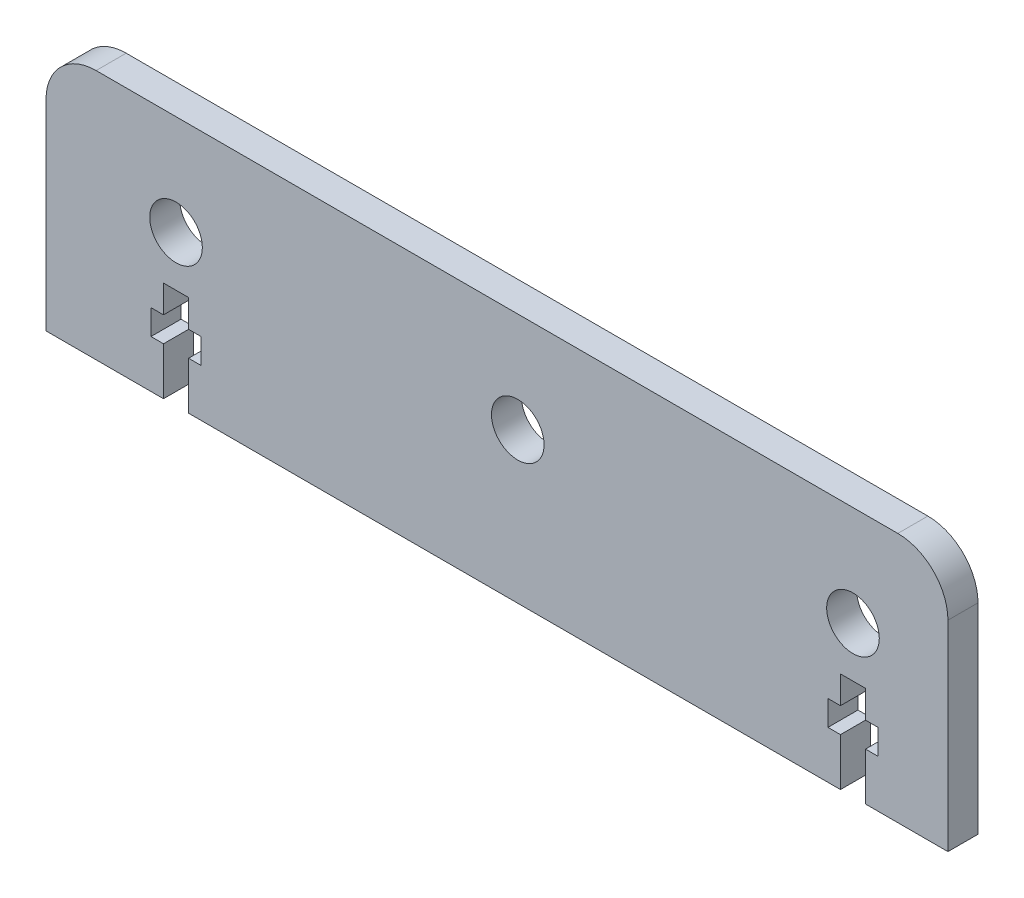
ISO-10303-21;
HEADER;
FILE_DESCRIPTION(('STEP AP214'),'2;1');
FILE_NAME('part.step','',(''),(''),'','','');
FILE_SCHEMA(('AUTOMOTIVE_DESIGN { 1 0 10303 214 1 1 1 1 }'));
ENDSEC;
DATA;
#1=APPLICATION_CONTEXT('core data for automotive mechanical design processes');
#2=APPLICATION_PROTOCOL_DEFINITION('international standard','automotive_design',2000,#1);
#3=PRODUCT_CONTEXT('',#1,'mechanical');
#4=PRODUCT('Part','Part','',(#3));
#5=PRODUCT_RELATED_PRODUCT_CATEGORY('part','',(#4));
#6=PRODUCT_DEFINITION_FORMATION('','',#4);
#7=PRODUCT_DEFINITION_CONTEXT('part definition',#1,'design');
#8=PRODUCT_DEFINITION('design','',#6,#7);
#9=PRODUCT_DEFINITION_SHAPE('','',#8);
#10=(LENGTH_UNIT() NAMED_UNIT(*) SI_UNIT(.MILLI.,.METRE.));
#11=(NAMED_UNIT(*) PLANE_ANGLE_UNIT() SI_UNIT($,.RADIAN.));
#12=(NAMED_UNIT(*) SI_UNIT($,.STERADIAN.) SOLID_ANGLE_UNIT());
#13=UNCERTAINTY_MEASURE_WITH_UNIT(LENGTH_MEASURE(1.E-05),#10,'distance_accuracy_value','');
#14=(GEOMETRIC_REPRESENTATION_CONTEXT(3) GLOBAL_UNCERTAINTY_ASSIGNED_CONTEXT((#13)) GLOBAL_UNIT_ASSIGNED_CONTEXT((#10,
#11,#12)) REPRESENTATION_CONTEXT('',''));
#15=CARTESIAN_POINT('',(0.,0.,0.));
#16=DIRECTION('',(0.,0.,1.));
#17=DIRECTION('',(1.,0.,0.));
#18=AXIS2_PLACEMENT_3D('',#15,#16,#17);
#19=CARTESIAN_POINT('',(90.,-25.,6.));
#20=DIRECTION('',(0.,1.,0.));
#21=DIRECTION('',(-1.,0.,0.));
#22=AXIS2_PLACEMENT_3D('',#19,#20,#21);
#23=PLANE('',#22);
#24=DIRECTION('',(0.,0.,-1.));
#25=VECTOR('',#24,1.);
#26=CARTESIAN_POINT('',(68.55,-25.,6.));
#27=LINE('',#26,#25);
#28=CARTESIAN_POINT('',(68.55,-25.,6.));
#29=VERTEX_POINT('',#28);
#30=CARTESIAN_POINT('',(68.55,-25.,0.));
#31=VERTEX_POINT('',#30);
#32=EDGE_CURVE('E342',#29,#31,#27,.T.);
#33=ORIENTED_EDGE('',*,*,#32,.F.);
#34=DIRECTION('',(1.,0.,0.));
#35=VECTOR('',#34,1.);
#36=CARTESIAN_POINT('',(90.,-25.,6.));
#37=LINE('',#36,#35);
#38=CARTESIAN_POINT('',(-61.55,-25.,6.));
#39=VERTEX_POINT('',#38);
#40=EDGE_CURVE('E465',#39,#29,#37,.T.);
#41=ORIENTED_EDGE('',*,*,#40,.F.);
#42=DIRECTION('',(0.,0.,-1.));
#43=VECTOR('',#42,1.);
#44=CARTESIAN_POINT('',(-61.55,-25.,6.));
#45=LINE('',#44,#43);
#46=CARTESIAN_POINT('',(-61.55,-25.,0.));
#47=VERTEX_POINT('',#46);
#48=EDGE_CURVE('E393',#39,#47,#45,.T.);
#49=ORIENTED_EDGE('',*,*,#48,.T.);
#50=DIRECTION('',(1.,0.,0.));
#51=VECTOR('',#50,1.);
#52=CARTESIAN_POINT('',(90.,-25.,0.));
#53=LINE('',#52,#51);
#54=EDGE_CURVE('E478',#47,#31,#53,.T.);
#55=ORIENTED_EDGE('',*,*,#54,.T.);
#56=EDGE_LOOP('',(#33,#41,#49,#55));
#57=FACE_BOUND('',#56,.T.);
#58=ADVANCED_FACE('F95',(#57),#23,.F.);
#59=CARTESIAN_POINT('',(0.,0.,6.));
#60=DIRECTION('',(0.,0.,1.));
#61=DIRECTION('',(1.,0.,0.));
#62=AXIS2_PLACEMENT_3D('',#59,#60,#61);
#63=PLANE('',#62);
#64=CARTESIAN_POINT('',(71.05,4.99999999999998,6.));
#65=DIRECTION('',(0.,0.,1.));
#66=DIRECTION('',(1.,0.,0.));
#67=AXIS2_PLACEMENT_3D('',#64,#65,#66);
#68=CIRCLE('',#67,5.25);
#69=CARTESIAN_POINT('',(76.3,4.99999999999998,6.));
#70=VERTEX_POINT('',#69);
#71=EDGE_CURVE('E438',#70,#70,#68,.T.);
#72=ORIENTED_EDGE('',*,*,#71,.F.);
#73=EDGE_LOOP('',(#72));
#74=FACE_BOUND('',#73,.T.);
#75=CARTESIAN_POINT('',(4.15000000000001,4.99999999999998,6.));
#76=DIRECTION('',(0.,0.,1.));
#77=DIRECTION('',(1.,0.,0.));
#78=AXIS2_PLACEMENT_3D('',#75,#76,#77);
#79=CIRCLE('',#78,5.25);
#80=CARTESIAN_POINT('',(9.40000000000002,4.99999999999998,6.));
#81=VERTEX_POINT('',#80);
#82=EDGE_CURVE('E442',#81,#81,#79,.T.);
#83=ORIENTED_EDGE('',*,*,#82,.F.);
#84=EDGE_LOOP('',(#83));
#85=FACE_BOUND('',#84,.T.);
#86=CARTESIAN_POINT('',(-64.05,4.99999999999998,6.));
#87=DIRECTION('',(0.,0.,1.));
#88=DIRECTION('',(1.,0.,0.));
#89=AXIS2_PLACEMENT_3D('',#86,#87,#88);
#90=CIRCLE('',#89,5.25);
#91=CARTESIAN_POINT('',(-58.8,4.99999999999998,6.));
#92=VERTEX_POINT('',#91);
#93=EDGE_CURVE('E448',#92,#92,#90,.T.);
#94=ORIENTED_EDGE('',*,*,#93,.F.);
#95=EDGE_LOOP('',(#94));
#96=FACE_BOUND('',#95,.T.);
#97=ORIENTED_EDGE('',*,*,#40,.T.);
#98=DIRECTION('',(0.,-1.,0.));
#99=VECTOR('',#98,1.);
#100=CARTESIAN_POINT('',(68.55,-5.00000000000002,6.));
#101=LINE('',#100,#99);
#102=CARTESIAN_POINT('',(68.55,-15.5,6.));
#103=VERTEX_POINT('',#102);
#104=EDGE_CURVE('E363',#103,#29,#101,.T.);
#105=ORIENTED_EDGE('',*,*,#104,.F.);
#106=DIRECTION('',(1.,0.,0.));
#107=VECTOR('',#106,1.);
#108=CARTESIAN_POINT('',(66.05,-15.5,6.));
#109=LINE('',#108,#107);
#110=CARTESIAN_POINT('',(66.05,-15.5,6.));
#111=VERTEX_POINT('',#110);
#112=EDGE_CURVE('E330',#111,#103,#109,.T.);
#113=ORIENTED_EDGE('',*,*,#112,.F.);
#114=DIRECTION('',(0.,-1.,0.));
#115=VECTOR('',#114,1.);
#116=CARTESIAN_POINT('',(66.05,-10.5,6.));
#117=LINE('',#116,#115);
#118=CARTESIAN_POINT('',(66.05,-10.5,6.));
#119=VERTEX_POINT('',#118);
#120=EDGE_CURVE('E328',#119,#111,#117,.T.);
#121=ORIENTED_EDGE('',*,*,#120,.F.);
#122=DIRECTION('',(1.,0.,0.));
#123=VECTOR('',#122,1.);
#124=CARTESIAN_POINT('',(66.05,-10.5,6.));
#125=LINE('',#124,#123);
#126=CARTESIAN_POINT('',(68.55,-10.5,6.));
#127=VERTEX_POINT('',#126);
#128=EDGE_CURVE('E299',#119,#127,#125,.T.);
#129=ORIENTED_EDGE('',*,*,#128,.T.);
#130=CARTESIAN_POINT('',(68.55,-5.00000000000002,6.));
#131=VERTEX_POINT('',#130);
#132=EDGE_CURVE('E360',#131,#127,#101,.T.);
#133=ORIENTED_EDGE('',*,*,#132,.F.);
#134=DIRECTION('',(-1.,0.,0.));
#135=VECTOR('',#134,1.);
#136=CARTESIAN_POINT('',(73.55,-5.00000000000002,6.));
#137=LINE('',#136,#135);
#138=CARTESIAN_POINT('',(73.55,-5.00000000000002,6.));
#139=VERTEX_POINT('',#138);
#140=EDGE_CURVE('E353',#139,#131,#137,.T.);
#141=ORIENTED_EDGE('',*,*,#140,.F.);
#142=DIRECTION('',(0.,-1.,0.));
#143=VECTOR('',#142,1.);
#144=CARTESIAN_POINT('',(73.55,-5.00000000000002,6.));
#145=LINE('',#144,#143);
#146=CARTESIAN_POINT('',(73.55,-10.5,6.));
#147=VERTEX_POINT('',#146);
#148=EDGE_CURVE('E350',#139,#147,#145,.T.);
#149=ORIENTED_EDGE('',*,*,#148,.T.);
#150=CARTESIAN_POINT('',(76.05,-10.5,6.));
#151=VERTEX_POINT('',#150);
#152=EDGE_CURVE('E313',#147,#151,#125,.T.);
#153=ORIENTED_EDGE('',*,*,#152,.T.);
#154=DIRECTION('',(0.,-1.,0.));
#155=VECTOR('',#154,1.);
#156=CARTESIAN_POINT('',(76.05,-10.5,6.));
#157=LINE('',#156,#155);
#158=CARTESIAN_POINT('',(76.05,-15.5,6.));
#159=VERTEX_POINT('',#158);
#160=EDGE_CURVE('E335',#151,#159,#157,.T.);
#161=ORIENTED_EDGE('',*,*,#160,.T.);
#162=CARTESIAN_POINT('',(73.55,-15.5,6.));
#163=VERTEX_POINT('',#162);
#164=EDGE_CURVE('E334',#163,#159,#109,.T.);
#165=ORIENTED_EDGE('',*,*,#164,.F.);
#166=CARTESIAN_POINT('',(73.55,-25.,6.));
#167=VERTEX_POINT('',#166);
#168=EDGE_CURVE('E359',#163,#167,#145,.T.);
#169=ORIENTED_EDGE('',*,*,#168,.T.);
#170=CARTESIAN_POINT('',(90.,-25.,6.));
#171=VERTEX_POINT('',#170);
#172=EDGE_CURVE('E459',#167,#171,#37,.T.);
#173=ORIENTED_EDGE('',*,*,#172,.T.);
#174=DIRECTION('',(0.,1.,0.));
#175=VECTOR('',#174,1.);
#176=CARTESIAN_POINT('',(90.,-25.,6.));
#177=LINE('',#176,#175);
#178=CARTESIAN_POINT('',(90.,15.,6.));
#179=VERTEX_POINT('',#178);
#180=EDGE_CURVE('E464',#171,#179,#177,.T.);
#181=ORIENTED_EDGE('',*,*,#180,.T.);
#182=CARTESIAN_POINT('',(80.,15.,6.));
#183=DIRECTION('',(0.,0.,1.));
#184=DIRECTION('',(1.,0.,0.));
#185=AXIS2_PLACEMENT_3D('',#182,#183,#184);
#186=CIRCLE('',#185,10.);
#187=CARTESIAN_POINT('',(80.,25.,6.));
#188=VERTEX_POINT('',#187);
#189=EDGE_CURVE('E103',#179,#188,#186,.T.);
#190=ORIENTED_EDGE('',*,*,#189,.T.);
#191=DIRECTION('',(-1.,0.,0.));
#192=VECTOR('',#191,1.);
#193=CARTESIAN_POINT('',(90.,25.,6.));
#194=LINE('',#193,#192);
#195=CARTESIAN_POINT('',(-79.9999999999999,25.,6.));
#196=VERTEX_POINT('',#195);
#197=EDGE_CURVE('E468',#188,#196,#194,.T.);
#198=ORIENTED_EDGE('',*,*,#197,.T.);
#199=CARTESIAN_POINT('',(-80.,15.,6.));
#200=DIRECTION('',(0.,0.,1.));
#201=DIRECTION('',(1.,0.,0.));
#202=AXIS2_PLACEMENT_3D('',#199,#200,#201);
#203=CIRCLE('',#202,10.);
#204=CARTESIAN_POINT('',(-90.,15.,6.));
#205=VERTEX_POINT('',#204);
#206=EDGE_CURVE('E499',#196,#205,#203,.T.);
#207=ORIENTED_EDGE('',*,*,#206,.T.);
#208=DIRECTION('',(0.,-1.,0.));
#209=VECTOR('',#208,1.);
#210=CARTESIAN_POINT('',(-90.,-25.,6.));
#211=LINE('',#210,#209);
#212=CARTESIAN_POINT('',(-90.,-25.,6.));
#213=VERTEX_POINT('',#212);
#214=EDGE_CURVE('E457',#205,#213,#211,.T.);
#215=ORIENTED_EDGE('',*,*,#214,.T.);
#216=CARTESIAN_POINT('',(-66.55,-25.,6.));
#217=VERTEX_POINT('',#216);
#218=EDGE_CURVE('E461',#213,#217,#37,.T.);
#219=ORIENTED_EDGE('',*,*,#218,.T.);
#220=DIRECTION('',(0.,-1.,0.));
#221=VECTOR('',#220,1.);
#222=CARTESIAN_POINT('',(-66.55,-5.00000000000001,6.));
#223=LINE('',#222,#221);
#224=CARTESIAN_POINT('',(-66.55,-15.5,6.));
#225=VERTEX_POINT('',#224);
#226=EDGE_CURVE('E373',#225,#217,#223,.T.);
#227=ORIENTED_EDGE('',*,*,#226,.F.);
#228=DIRECTION('',(1.,0.,0.));
#229=VECTOR('',#228,1.);
#230=CARTESIAN_POINT('',(-69.05,-15.5,6.));
#231=LINE('',#230,#229);
#232=CARTESIAN_POINT('',(-69.05,-15.5,6.));
#233=VERTEX_POINT('',#232);
#234=EDGE_CURVE('E405',#233,#225,#231,.T.);
#235=ORIENTED_EDGE('',*,*,#234,.F.);
#236=DIRECTION('',(0.,-1.,0.));
#237=VECTOR('',#236,1.);
#238=CARTESIAN_POINT('',(-69.05,-10.5,6.));
#239=LINE('',#238,#237);
#240=CARTESIAN_POINT('',(-69.05,-10.5,6.));
#241=VERTEX_POINT('',#240);
#242=EDGE_CURVE('E408',#241,#233,#239,.T.);
#243=ORIENTED_EDGE('',*,*,#242,.F.);
#244=DIRECTION('',(1.,0.,0.));
#245=VECTOR('',#244,1.);
#246=CARTESIAN_POINT('',(-69.05,-10.5,6.));
#247=LINE('',#246,#245);
#248=CARTESIAN_POINT('',(-66.55,-10.5,6.));
#249=VERTEX_POINT('',#248);
#250=EDGE_CURVE('E397',#241,#249,#247,.T.);
#251=ORIENTED_EDGE('',*,*,#250,.T.);
#252=CARTESIAN_POINT('',(-66.55,-5.00000000000001,6.));
#253=VERTEX_POINT('',#252);
#254=EDGE_CURVE('E374',#253,#249,#223,.T.);
#255=ORIENTED_EDGE('',*,*,#254,.F.);
#256=DIRECTION('',(1.,0.,0.));
#257=VECTOR('',#256,1.);
#258=CARTESIAN_POINT('',(-66.55,-5.00000000000001,6.));
#259=LINE('',#258,#257);
#260=CARTESIAN_POINT('',(-61.55,-5.00000000000001,6.));
#261=VERTEX_POINT('',#260);
#262=EDGE_CURVE('E365',#253,#261,#259,.T.);
#263=ORIENTED_EDGE('',*,*,#262,.T.);
#264=DIRECTION('',(0.,-1.,0.));
#265=VECTOR('',#264,1.);
#266=CARTESIAN_POINT('',(-61.55,-5.00000000000001,6.));
#267=LINE('',#266,#265);
#268=CARTESIAN_POINT('',(-61.55,-10.5,6.));
#269=VERTEX_POINT('',#268);
#270=EDGE_CURVE('E370',#261,#269,#267,.T.);
#271=ORIENTED_EDGE('',*,*,#270,.T.);
#272=CARTESIAN_POINT('',(-59.05,-10.5,6.));
#273=VERTEX_POINT('',#272);
#274=EDGE_CURVE('E401',#269,#273,#247,.T.);
#275=ORIENTED_EDGE('',*,*,#274,.T.);
#276=DIRECTION('',(0.,-1.,0.));
#277=VECTOR('',#276,1.);
#278=CARTESIAN_POINT('',(-59.05,-10.5,6.));
#279=LINE('',#278,#277);
#280=CARTESIAN_POINT('',(-59.05,-15.5,6.));
#281=VERTEX_POINT('',#280);
#282=EDGE_CURVE('E400',#273,#281,#279,.T.);
#283=ORIENTED_EDGE('',*,*,#282,.T.);
#284=CARTESIAN_POINT('',(-61.55,-15.5,6.));
#285=VERTEX_POINT('',#284);
#286=EDGE_CURVE('E404',#285,#281,#231,.T.);
#287=ORIENTED_EDGE('',*,*,#286,.F.);
#288=EDGE_CURVE('E368',#285,#39,#267,.T.);
#289=ORIENTED_EDGE('',*,*,#288,.T.);
#290=EDGE_LOOP('',(#97,#105,#113,#121,#129,#133,#141,#149,#153,#161,#165,#169,#173,#181,#190,
#198,#207,#215,#219,#227,#235,#243,#251,#255,#263,#271,#275,#283,#287,#289));
#291=FACE_BOUND('',#290,.T.);
#292=ADVANCED_FACE('F504',(#74,#85,#96,#291),#63,.T.);
#293=CARTESIAN_POINT('',(0.,0.,0.));
#294=DIRECTION('',(0.,0.,1.));
#295=DIRECTION('',(1.,0.,0.));
#296=AXIS2_PLACEMENT_3D('',#293,#294,#295);
#297=PLANE('',#296);
#298=CARTESIAN_POINT('',(-64.05,4.99999999999998,0.));
#299=DIRECTION('',(0.,0.,1.));
#300=DIRECTION('',(1.,0.,0.));
#301=AXIS2_PLACEMENT_3D('',#298,#299,#300);
#302=CIRCLE('',#301,5.25);
#303=CARTESIAN_POINT('',(-58.8,4.99999999999998,0.));
#304=VERTEX_POINT('',#303);
#305=EDGE_CURVE('E451',#304,#304,#302,.T.);
#306=ORIENTED_EDGE('',*,*,#305,.T.);
#307=EDGE_LOOP('',(#306));
#308=FACE_BOUND('',#307,.T.);
#309=CARTESIAN_POINT('',(4.15000000000001,4.99999999999998,0.));
#310=DIRECTION('',(0.,0.,1.));
#311=DIRECTION('',(1.,0.,0.));
#312=AXIS2_PLACEMENT_3D('',#309,#310,#311);
#313=CIRCLE('',#312,5.25);
#314=CARTESIAN_POINT('',(9.40000000000002,4.99999999999998,0.));
#315=VERTEX_POINT('',#314);
#316=EDGE_CURVE('E445',#315,#315,#313,.T.);
#317=ORIENTED_EDGE('',*,*,#316,.T.);
#318=EDGE_LOOP('',(#317));
#319=FACE_BOUND('',#318,.T.);
#320=CARTESIAN_POINT('',(71.05,4.99999999999998,0.));
#321=DIRECTION('',(0.,0.,1.));
#322=DIRECTION('',(1.,0.,0.));
#323=AXIS2_PLACEMENT_3D('',#320,#321,#322);
#324=CIRCLE('',#323,5.25);
#325=CARTESIAN_POINT('',(76.3,4.99999999999998,0.));
#326=VERTEX_POINT('',#325);
#327=EDGE_CURVE('E439',#326,#326,#324,.T.);
#328=ORIENTED_EDGE('',*,*,#327,.T.);
#329=EDGE_LOOP('',(#328));
#330=FACE_BOUND('',#329,.T.);
#331=DIRECTION('',(0.,-1.,0.));
#332=VECTOR('',#331,1.);
#333=CARTESIAN_POINT('',(68.55,-5.00000000000002,0.));
#334=LINE('',#333,#332);
#335=CARTESIAN_POINT('',(68.55,-15.5,0.));
#336=VERTEX_POINT('',#335);
#337=EDGE_CURVE('E355',#336,#31,#334,.T.);
#338=ORIENTED_EDGE('',*,*,#337,.T.);
#339=ORIENTED_EDGE('',*,*,#54,.F.);
#340=DIRECTION('',(0.,-1.,0.));
#341=VECTOR('',#340,1.);
#342=CARTESIAN_POINT('',(-61.55,-5.00000000000001,0.));
#343=LINE('',#342,#341);
#344=CARTESIAN_POINT('',(-61.55,-15.5,0.));
#345=VERTEX_POINT('',#344);
#346=EDGE_CURVE('E381',#345,#47,#343,.T.);
#347=ORIENTED_EDGE('',*,*,#346,.F.);
#348=DIRECTION('',(1.,0.,0.));
#349=VECTOR('',#348,1.);
#350=CARTESIAN_POINT('',(-69.05,-15.5,0.));
#351=LINE('',#350,#349);
#352=CARTESIAN_POINT('',(-59.05,-15.5,0.));
#353=VERTEX_POINT('',#352);
#354=EDGE_CURVE('E417',#345,#353,#351,.T.);
#355=ORIENTED_EDGE('',*,*,#354,.T.);
#356=DIRECTION('',(0.,-1.,0.));
#357=VECTOR('',#356,1.);
#358=CARTESIAN_POINT('',(-59.05,-10.5,0.));
#359=LINE('',#358,#357);
#360=CARTESIAN_POINT('',(-59.05,-10.5,0.));
#361=VERTEX_POINT('',#360);
#362=EDGE_CURVE('E414',#361,#353,#359,.T.);
#363=ORIENTED_EDGE('',*,*,#362,.F.);
#364=DIRECTION('',(1.,0.,0.));
#365=VECTOR('',#364,1.);
#366=CARTESIAN_POINT('',(-69.05,-10.5,0.));
#367=LINE('',#366,#365);
#368=CARTESIAN_POINT('',(-61.55,-10.5,0.));
#369=VERTEX_POINT('',#368);
#370=EDGE_CURVE('E322',#369,#361,#367,.T.);
#371=ORIENTED_EDGE('',*,*,#370,.F.);
#372=CARTESIAN_POINT('',(-61.55,-5.00000000000001,0.));
#373=VERTEX_POINT('',#372);
#374=EDGE_CURVE('E383',#373,#369,#343,.T.);
#375=ORIENTED_EDGE('',*,*,#374,.F.);
#376=DIRECTION('',(1.,0.,0.));
#377=VECTOR('',#376,1.);
#378=CARTESIAN_POINT('',(-66.55,-5.00000000000001,0.));
#379=LINE('',#378,#377);
#380=CARTESIAN_POINT('',(-66.55,-5.00000000000001,0.));
#381=VERTEX_POINT('',#380);
#382=EDGE_CURVE('E378',#381,#373,#379,.T.);
#383=ORIENTED_EDGE('',*,*,#382,.F.);
#384=DIRECTION('',(0.,-1.,0.));
#385=VECTOR('',#384,1.);
#386=CARTESIAN_POINT('',(-66.55,-5.00000000000001,0.));
#387=LINE('',#386,#385);
#388=CARTESIAN_POINT('',(-66.55,-10.5,0.));
#389=VERTEX_POINT('',#388);
#390=EDGE_CURVE('E369',#381,#389,#387,.T.);
#391=ORIENTED_EDGE('',*,*,#390,.T.);
#392=CARTESIAN_POINT('',(-69.05,-10.5,0.));
#393=VERTEX_POINT('',#392);
#394=EDGE_CURVE('E411',#393,#389,#367,.T.);
#395=ORIENTED_EDGE('',*,*,#394,.F.);
#396=DIRECTION('',(0.,-1.,0.));
#397=VECTOR('',#396,1.);
#398=CARTESIAN_POINT('',(-69.05,-10.5,0.));
#399=LINE('',#398,#397);
#400=CARTESIAN_POINT('',(-69.05,-15.5,0.));
#401=VERTEX_POINT('',#400);
#402=EDGE_CURVE('E421',#393,#401,#399,.T.);
#403=ORIENTED_EDGE('',*,*,#402,.T.);
#404=CARTESIAN_POINT('',(-66.55,-15.5,0.));
#405=VERTEX_POINT('',#404);
#406=EDGE_CURVE('E418',#401,#405,#351,.T.);
#407=ORIENTED_EDGE('',*,*,#406,.T.);
#408=CARTESIAN_POINT('',(-66.55,-25.,0.));
#409=VERTEX_POINT('',#408);
#410=EDGE_CURVE('E118',#405,#409,#387,.T.);
#411=ORIENTED_EDGE('',*,*,#410,.T.);
#412=CARTESIAN_POINT('',(-90.,-25.,0.));
#413=VERTEX_POINT('',#412);
#414=EDGE_CURVE('E474',#413,#409,#53,.T.);
#415=ORIENTED_EDGE('',*,*,#414,.F.);
#416=DIRECTION('',(0.,-1.,0.));
#417=VECTOR('',#416,1.);
#418=CARTESIAN_POINT('',(-90.,-25.,0.));
#419=LINE('',#418,#417);
#420=CARTESIAN_POINT('',(-90.,15.,0.));
#421=VERTEX_POINT('',#420);
#422=EDGE_CURVE('E454',#421,#413,#419,.T.);
#423=ORIENTED_EDGE('',*,*,#422,.F.);
#424=CARTESIAN_POINT('',(-80.,15.,0.));
#425=DIRECTION('',(0.,0.,1.));
#426=DIRECTION('',(1.,0.,0.));
#427=AXIS2_PLACEMENT_3D('',#424,#425,#426);
#428=CIRCLE('',#427,10.);
#429=CARTESIAN_POINT('',(-79.9999999999999,25.,0.));
#430=VERTEX_POINT('',#429);
#431=EDGE_CURVE('E493',#421,#430,#428,.F.);
#432=ORIENTED_EDGE('',*,*,#431,.T.);
#433=DIRECTION('',(-1.,0.,0.));
#434=VECTOR('',#433,1.);
#435=CARTESIAN_POINT('',(90.,25.,0.));
#436=LINE('',#435,#434);
#437=CARTESIAN_POINT('',(80.,25.,0.));
#438=VERTEX_POINT('',#437);
#439=EDGE_CURVE('E460',#438,#430,#436,.T.);
#440=ORIENTED_EDGE('',*,*,#439,.F.);
#441=CARTESIAN_POINT('',(80.,15.,0.));
#442=DIRECTION('',(0.,0.,1.));
#443=DIRECTION('',(1.,0.,0.));
#444=AXIS2_PLACEMENT_3D('',#441,#442,#443);
#445=CIRCLE('',#444,10.);
#446=CARTESIAN_POINT('',(90.,15.,0.));
#447=VERTEX_POINT('',#446);
#448=EDGE_CURVE('E495',#438,#447,#445,.F.);
#449=ORIENTED_EDGE('',*,*,#448,.T.);
#450=DIRECTION('',(0.,1.,0.));
#451=VECTOR('',#450,1.);
#452=CARTESIAN_POINT('',(90.,-25.,0.));
#453=LINE('',#452,#451);
#454=CARTESIAN_POINT('',(90.,-25.,0.));
#455=VERTEX_POINT('',#454);
#456=EDGE_CURVE('E477',#455,#447,#453,.T.);
#457=ORIENTED_EDGE('',*,*,#456,.F.);
#458=CARTESIAN_POINT('',(73.55,-25.,0.));
#459=VERTEX_POINT('',#458);
#460=EDGE_CURVE('E473',#459,#455,#53,.T.);
#461=ORIENTED_EDGE('',*,*,#460,.F.);
#462=DIRECTION('',(0.,-1.,0.));
#463=VECTOR('',#462,1.);
#464=CARTESIAN_POINT('',(73.55,-5.00000000000002,0.));
#465=LINE('',#464,#463);
#466=CARTESIAN_POINT('',(73.55,-15.5,0.));
#467=VERTEX_POINT('',#466);
#468=EDGE_CURVE('E352',#467,#459,#465,.T.);
#469=ORIENTED_EDGE('',*,*,#468,.F.);
#470=DIRECTION('',(1.,0.,0.));
#471=VECTOR('',#470,1.);
#472=CARTESIAN_POINT('',(66.05,-15.5,0.));
#473=LINE('',#472,#471);
#474=CARTESIAN_POINT('',(76.05,-15.5,0.));
#475=VERTEX_POINT('',#474);
#476=EDGE_CURVE('E324',#467,#475,#473,.T.);
#477=ORIENTED_EDGE('',*,*,#476,.T.);
#478=DIRECTION('',(0.,-1.,0.));
#479=VECTOR('',#478,1.);
#480=CARTESIAN_POINT('',(76.05,-10.5,0.));
#481=LINE('',#480,#479);
#482=CARTESIAN_POINT('',(76.05,-10.5,0.));
#483=VERTEX_POINT('',#482);
#484=EDGE_CURVE('E320',#483,#475,#481,.T.);
#485=ORIENTED_EDGE('',*,*,#484,.F.);
#486=DIRECTION('',(1.,0.,0.));
#487=VECTOR('',#486,1.);
#488=CARTESIAN_POINT('',(66.05,-10.5,0.));
#489=LINE('',#488,#487);
#490=CARTESIAN_POINT('',(73.55,-10.5,0.));
#491=VERTEX_POINT('',#490);
#492=EDGE_CURVE('E319',#491,#483,#489,.T.);
#493=ORIENTED_EDGE('',*,*,#492,.F.);
#494=CARTESIAN_POINT('',(73.55,-5.00000000000002,0.));
#495=VERTEX_POINT('',#494);
#496=EDGE_CURVE('E110',#495,#491,#465,.T.);
#497=ORIENTED_EDGE('',*,*,#496,.F.);
#498=DIRECTION('',(-1.,0.,0.));
#499=VECTOR('',#498,1.);
#500=CARTESIAN_POINT('',(73.55,-5.00000000000002,0.));
#501=LINE('',#500,#499);
#502=CARTESIAN_POINT('',(68.55,-5.00000000000002,0.));
#503=VERTEX_POINT('',#502);
#504=EDGE_CURVE('E303',#495,#503,#501,.T.);
#505=ORIENTED_EDGE('',*,*,#504,.T.);
#506=CARTESIAN_POINT('',(68.55,-10.5,0.));
#507=VERTEX_POINT('',#506);
#508=EDGE_CURVE('E318',#503,#507,#334,.T.);
#509=ORIENTED_EDGE('',*,*,#508,.T.);
#510=CARTESIAN_POINT('',(66.05,-10.5,0.));
#511=VERTEX_POINT('',#510);
#512=EDGE_CURVE('E296',#511,#507,#489,.T.);
#513=ORIENTED_EDGE('',*,*,#512,.F.);
#514=DIRECTION('',(0.,-1.,0.));
#515=VECTOR('',#514,1.);
#516=CARTESIAN_POINT('',(66.05,-10.5,0.));
#517=LINE('',#516,#515);
#518=CARTESIAN_POINT('',(66.05,-15.5,0.));
#519=VERTEX_POINT('',#518);
#520=EDGE_CURVE('E306',#511,#519,#517,.T.);
#521=ORIENTED_EDGE('',*,*,#520,.T.);
#522=EDGE_CURVE('E312',#519,#336,#473,.T.);
#523=ORIENTED_EDGE('',*,*,#522,.T.);
#524=EDGE_LOOP('',(#338,#339,#347,#355,#363,#371,#375,#383,#391,#395,#403,#407,#411,#415,#423,
#432,#440,#449,#457,#461,#469,#477,#485,#493,#497,#505,#509,#513,#521,#523));
#525=FACE_BOUND('',#524,.T.);
#526=ADVANCED_FACE('F316',(#308,#319,#330,#525),#297,.F.);
#527=DIRECTION('',(0.,0.,-1.));
#528=VECTOR('',#527,1.);
#529=CARTESIAN_POINT('',(-66.55,-25.,6.));
#530=LINE('',#529,#528);
#531=EDGE_CURVE('E391',#217,#409,#530,.T.);
#532=ORIENTED_EDGE('',*,*,#531,.F.);
#533=ORIENTED_EDGE('',*,*,#218,.F.);
#534=DIRECTION('',(0.,0.,-1.));
#535=VECTOR('',#534,1.);
#536=CARTESIAN_POINT('',(-90.,-25.,6.));
#537=LINE('',#536,#535);
#538=EDGE_CURVE('E485',#213,#413,#537,.T.);
#539=ORIENTED_EDGE('',*,*,#538,.T.);
#540=ORIENTED_EDGE('',*,*,#414,.T.);
#541=EDGE_LOOP('',(#532,#533,#539,#540));
#542=FACE_BOUND('',#541,.T.);
#543=ADVANCED_FACE('F583',(#542),#23,.F.);
#544=CARTESIAN_POINT('',(-90.,-25.,6.));
#545=DIRECTION('',(1.,0.,0.));
#546=DIRECTION('',(0.,0.,-1.));
#547=AXIS2_PLACEMENT_3D('',#544,#545,#546);
#548=PLANE('',#547);
#549=ORIENTED_EDGE('',*,*,#214,.F.);
#550=DIRECTION('',(0.,0.,-1.));
#551=VECTOR('',#550,1.);
#552=CARTESIAN_POINT('',(-90.,15.,6.));
#553=LINE('',#552,#551);
#554=EDGE_CURVE('E14',#205,#421,#553,.T.);
#555=ORIENTED_EDGE('',*,*,#554,.T.);
#556=ORIENTED_EDGE('',*,*,#422,.T.);
#557=ORIENTED_EDGE('',*,*,#538,.F.);
#558=EDGE_LOOP('',(#549,#555,#556,#557));
#559=FACE_BOUND('',#558,.T.);
#560=ADVANCED_FACE('F592',(#559),#548,.F.);
#561=ORIENTED_EDGE('',*,*,#172,.F.);
#562=DIRECTION('',(0.,0.,-1.));
#563=VECTOR('',#562,1.);
#564=CARTESIAN_POINT('',(73.55,-25.,6.));
#565=LINE('',#564,#563);
#566=EDGE_CURVE('E345',#167,#459,#565,.T.);
#567=ORIENTED_EDGE('',*,*,#566,.T.);
#568=ORIENTED_EDGE('',*,*,#460,.T.);
#569=DIRECTION('',(0.,0.,-1.));
#570=VECTOR('',#569,1.);
#571=CARTESIAN_POINT('',(90.,-25.,6.));
#572=LINE('',#571,#570);
#573=EDGE_CURVE('E471',#171,#455,#572,.T.);
#574=ORIENTED_EDGE('',*,*,#573,.F.);
#575=EDGE_LOOP('',(#561,#567,#568,#574));
#576=FACE_BOUND('',#575,.T.);
#577=ADVANCED_FACE('F522',(#576),#23,.F.);
#578=CARTESIAN_POINT('',(90.,-25.,6.));
#579=DIRECTION('',(-1.,0.,0.));
#580=DIRECTION('',(0.,0.,1.));
#581=AXIS2_PLACEMENT_3D('',#578,#579,#580);
#582=PLANE('',#581);
#583=ORIENTED_EDGE('',*,*,#456,.T.);
#584=DIRECTION('',(0.,0.,-1.));
#585=VECTOR('',#584,1.);
#586=CARTESIAN_POINT('',(90.,15.,6.));
#587=LINE('',#586,#585);
#588=EDGE_CURVE('E497',#447,#179,#587,.F.);
#589=ORIENTED_EDGE('',*,*,#588,.T.);
#590=ORIENTED_EDGE('',*,*,#180,.F.);
#591=ORIENTED_EDGE('',*,*,#573,.T.);
#592=EDGE_LOOP('',(#583,#589,#590,#591));
#593=FACE_BOUND('',#592,.T.);
#594=ADVANCED_FACE('F518',(#593),#582,.F.);
#595=CARTESIAN_POINT('',(90.,25.,6.));
#596=DIRECTION('',(0.,-1.,0.));
#597=DIRECTION('',(1.,0.,0.));
#598=AXIS2_PLACEMENT_3D('',#595,#596,#597);
#599=PLANE('',#598);
#600=ORIENTED_EDGE('',*,*,#197,.F.);
#601=DIRECTION('',(0.,0.,-1.));
#602=VECTOR('',#601,1.);
#603=CARTESIAN_POINT('',(80.,25.,6.));
#604=LINE('',#603,#602);
#605=EDGE_CURVE('E490',#188,#438,#604,.T.);
#606=ORIENTED_EDGE('',*,*,#605,.T.);
#607=ORIENTED_EDGE('',*,*,#439,.T.);
#608=DIRECTION('',(0.,0.,-1.));
#609=VECTOR('',#608,1.);
#610=CARTESIAN_POINT('',(-80.,25.,6.));
#611=LINE('',#610,#609);
#612=EDGE_CURVE('E488',#430,#196,#611,.F.);
#613=ORIENTED_EDGE('',*,*,#612,.T.);
#614=EDGE_LOOP('',(#600,#606,#607,#613));
#615=FACE_BOUND('',#614,.T.);
#616=ADVANCED_FACE('F511',(#615),#599,.F.);
#617=CARTESIAN_POINT('',(-64.05,4.99999999999998,0.));
#618=DIRECTION('',(0.,0.,1.));
#619=DIRECTION('',(1.,0.,0.));
#620=AXIS2_PLACEMENT_3D('',#617,#618,#619);
#621=CYLINDRICAL_SURFACE('',#620,5.25);
#622=ORIENTED_EDGE('',*,*,#305,.F.);
#623=EDGE_LOOP('',(#622));
#624=FACE_BOUND('',#623,.T.);
#625=ORIENTED_EDGE('',*,*,#93,.T.);
#626=EDGE_LOOP('',(#625));
#627=FACE_BOUND('',#626,.T.);
#628=ADVANCED_FACE('F617',(#624,#627),#621,.F.);
#629=CARTESIAN_POINT('',(4.15000000000001,4.99999999999998,0.));
#630=DIRECTION('',(0.,0.,1.));
#631=DIRECTION('',(1.,0.,0.));
#632=AXIS2_PLACEMENT_3D('',#629,#630,#631);
#633=CYLINDRICAL_SURFACE('',#632,5.25);
#634=ORIENTED_EDGE('',*,*,#316,.F.);
#635=EDGE_LOOP('',(#634));
#636=FACE_BOUND('',#635,.T.);
#637=ORIENTED_EDGE('',*,*,#82,.T.);
#638=EDGE_LOOP('',(#637));
#639=FACE_BOUND('',#638,.T.);
#640=ADVANCED_FACE('F611',(#636,#639),#633,.F.);
#641=CARTESIAN_POINT('',(71.05,4.99999999999998,0.));
#642=DIRECTION('',(0.,0.,1.));
#643=DIRECTION('',(1.,0.,0.));
#644=AXIS2_PLACEMENT_3D('',#641,#642,#643);
#645=CYLINDRICAL_SURFACE('',#644,5.25);
#646=ORIENTED_EDGE('',*,*,#327,.F.);
#647=EDGE_LOOP('',(#646));
#648=FACE_BOUND('',#647,.T.);
#649=ORIENTED_EDGE('',*,*,#71,.T.);
#650=EDGE_LOOP('',(#649));
#651=FACE_BOUND('',#650,.T.);
#652=ADVANCED_FACE('F604',(#648,#651),#645,.F.);
#653=CARTESIAN_POINT('',(80.,15.,6.));
#654=DIRECTION('',(0.,0.,-1.));
#655=DIRECTION('',(-1.,0.,0.));
#656=AXIS2_PLACEMENT_3D('',#653,#654,#655);
#657=CYLINDRICAL_SURFACE('',#656,10.);
#658=ORIENTED_EDGE('',*,*,#189,.F.);
#659=ORIENTED_EDGE('',*,*,#588,.F.);
#660=ORIENTED_EDGE('',*,*,#448,.F.);
#661=ORIENTED_EDGE('',*,*,#605,.F.);
#662=EDGE_LOOP('',(#658,#659,#660,#661));
#663=FACE_BOUND('',#662,.T.);
#664=ADVANCED_FACE('F514',(#663),#657,.T.);
#665=CARTESIAN_POINT('',(-80.,15.,6.));
#666=DIRECTION('',(0.,0.,-1.));
#667=DIRECTION('',(-1.,0.,0.));
#668=AXIS2_PLACEMENT_3D('',#665,#666,#667);
#669=CYLINDRICAL_SURFACE('',#668,10.);
#670=ORIENTED_EDGE('',*,*,#206,.F.);
#671=ORIENTED_EDGE('',*,*,#612,.F.);
#672=ORIENTED_EDGE('',*,*,#431,.F.);
#673=ORIENTED_EDGE('',*,*,#554,.F.);
#674=EDGE_LOOP('',(#670,#671,#672,#673));
#675=FACE_BOUND('',#674,.T.);
#676=ADVANCED_FACE('F97',(#675),#669,.T.);
#677=CARTESIAN_POINT('',(-61.55,-5.00000000000001,6.));
#678=DIRECTION('',(1.,0.,0.));
#679=DIRECTION('',(0.,0.,-1.));
#680=AXIS2_PLACEMENT_3D('',#677,#678,#679);
#681=PLANE('',#680);
#682=ORIENTED_EDGE('',*,*,#346,.T.);
#683=ORIENTED_EDGE('',*,*,#48,.F.);
#684=ORIENTED_EDGE('',*,*,#288,.F.);
#685=DIRECTION('',(0.,0.,1.));
#686=VECTOR('',#685,1.);
#687=CARTESIAN_POINT('',(-61.55,-15.5,6.));
#688=LINE('',#687,#686);
#689=EDGE_CURVE('E390',#345,#285,#688,.T.);
#690=ORIENTED_EDGE('',*,*,#689,.F.);
#691=EDGE_LOOP('',(#682,#683,#684,#690));
#692=FACE_BOUND('',#691,.T.);
#693=ADVANCED_FACE('F609',(#692),#681,.F.);
#694=CARTESIAN_POINT('',(-66.55,-5.00000000000001,6.));
#695=DIRECTION('',(1.,0.,0.));
#696=DIRECTION('',(0.,0.,-1.));
#697=AXIS2_PLACEMENT_3D('',#694,#695,#696);
#698=PLANE('',#697);
#699=DIRECTION('',(0.,0.,1.));
#700=VECTOR('',#699,1.);
#701=CARTESIAN_POINT('',(-66.55,-15.5,6.));
#702=LINE('',#701,#700);
#703=EDGE_CURVE('E433',#405,#225,#702,.T.);
#704=ORIENTED_EDGE('',*,*,#703,.T.);
#705=ORIENTED_EDGE('',*,*,#226,.T.);
#706=ORIENTED_EDGE('',*,*,#531,.T.);
#707=ORIENTED_EDGE('',*,*,#410,.F.);
#708=EDGE_LOOP('',(#704,#705,#706,#707));
#709=FACE_BOUND('',#708,.T.);
#710=ADVANCED_FACE('F718',(#709),#698,.T.);
#711=DIRECTION('',(0.,0.,1.));
#712=VECTOR('',#711,1.);
#713=CARTESIAN_POINT('',(-61.55,-10.5,6.));
#714=LINE('',#713,#712);
#715=EDGE_CURVE('E432',#369,#269,#714,.T.);
#716=ORIENTED_EDGE('',*,*,#715,.T.);
#717=ORIENTED_EDGE('',*,*,#270,.F.);
#718=DIRECTION('',(0.,0.,-1.));
#719=VECTOR('',#718,1.);
#720=CARTESIAN_POINT('',(-61.55,-5.00000000000001,6.));
#721=LINE('',#720,#719);
#722=EDGE_CURVE('E377',#261,#373,#721,.T.);
#723=ORIENTED_EDGE('',*,*,#722,.T.);
#724=ORIENTED_EDGE('',*,*,#374,.T.);
#725=EDGE_LOOP('',(#716,#717,#723,#724));
#726=FACE_BOUND('',#725,.T.);
#727=ADVANCED_FACE('F721',(#726),#681,.F.);
#728=CARTESIAN_POINT('',(-66.55,-5.00000000000001,6.));
#729=DIRECTION('',(0.,1.,0.));
#730=DIRECTION('',(0.,0.,1.));
#731=AXIS2_PLACEMENT_3D('',#728,#729,#730);
#732=PLANE('',#731);
#733=ORIENTED_EDGE('',*,*,#382,.T.);
#734=ORIENTED_EDGE('',*,*,#722,.F.);
#735=ORIENTED_EDGE('',*,*,#262,.F.);
#736=DIRECTION('',(0.,0.,-1.));
#737=VECTOR('',#736,1.);
#738=CARTESIAN_POINT('',(-66.55,-5.00000000000001,6.));
#739=LINE('',#738,#737);
#740=EDGE_CURVE('E388',#253,#381,#739,.T.);
#741=ORIENTED_EDGE('',*,*,#740,.T.);
#742=EDGE_LOOP('',(#733,#734,#735,#741));
#743=FACE_BOUND('',#742,.T.);
#744=ADVANCED_FACE('F738',(#743),#732,.F.);
#745=ORIENTED_EDGE('',*,*,#390,.F.);
#746=ORIENTED_EDGE('',*,*,#740,.F.);
#747=ORIENTED_EDGE('',*,*,#254,.T.);
#748=DIRECTION('',(0.,0.,1.));
#749=VECTOR('',#748,1.);
#750=CARTESIAN_POINT('',(-66.55,-10.5,6.));
#751=LINE('',#750,#749);
#752=EDGE_CURVE('E435',#389,#249,#751,.T.);
#753=ORIENTED_EDGE('',*,*,#752,.F.);
#754=EDGE_LOOP('',(#745,#746,#747,#753));
#755=FACE_BOUND('',#754,.T.);
#756=ADVANCED_FACE('F730',(#755),#698,.T.);
#757=CARTESIAN_POINT('',(-59.05,-10.5,6.));
#758=DIRECTION('',(1.,0.,0.));
#759=DIRECTION('',(0.,0.,-1.));
#760=AXIS2_PLACEMENT_3D('',#757,#758,#759);
#761=PLANE('',#760);
#762=ORIENTED_EDGE('',*,*,#362,.T.);
#763=DIRECTION('',(0.,0.,-1.));
#764=VECTOR('',#763,1.);
#765=CARTESIAN_POINT('',(-59.05,-15.5,6.));
#766=LINE('',#765,#764);
#767=EDGE_CURVE('E427',#281,#353,#766,.T.);
#768=ORIENTED_EDGE('',*,*,#767,.F.);
#769=ORIENTED_EDGE('',*,*,#282,.F.);
#770=DIRECTION('',(0.,0.,-1.));
#771=VECTOR('',#770,1.);
#772=CARTESIAN_POINT('',(-59.05,-10.5,6.));
#773=LINE('',#772,#771);
#774=EDGE_CURVE('E410',#273,#361,#773,.T.);
#775=ORIENTED_EDGE('',*,*,#774,.T.);
#776=EDGE_LOOP('',(#762,#768,#769,#775));
#777=FACE_BOUND('',#776,.T.);
#778=ADVANCED_FACE('F756',(#777),#761,.F.);
#779=CARTESIAN_POINT('',(-69.05,-10.5,6.));
#780=DIRECTION('',(0.,1.,0.));
#781=DIRECTION('',(-1.,0.,0.));
#782=AXIS2_PLACEMENT_3D('',#779,#780,#781);
#783=PLANE('',#782);
#784=ORIENTED_EDGE('',*,*,#370,.T.);
#785=ORIENTED_EDGE('',*,*,#774,.F.);
#786=ORIENTED_EDGE('',*,*,#274,.F.);
#787=ORIENTED_EDGE('',*,*,#715,.F.);
#788=EDGE_LOOP('',(#784,#785,#786,#787));
#789=FACE_BOUND('',#788,.T.);
#790=ADVANCED_FACE('F623',(#789),#783,.F.);
#791=CARTESIAN_POINT('',(-69.05,-15.5,6.));
#792=DIRECTION('',(0.,1.,0.));
#793=DIRECTION('',(-1.,0.,0.));
#794=AXIS2_PLACEMENT_3D('',#791,#792,#793);
#795=PLANE('',#794);
#796=ORIENTED_EDGE('',*,*,#689,.T.);
#797=ORIENTED_EDGE('',*,*,#286,.T.);
#798=ORIENTED_EDGE('',*,*,#767,.T.);
#799=ORIENTED_EDGE('',*,*,#354,.F.);
#800=EDGE_LOOP('',(#796,#797,#798,#799));
#801=FACE_BOUND('',#800,.T.);
#802=ADVANCED_FACE('F773',(#801),#795,.T.);
#803=ORIENTED_EDGE('',*,*,#752,.T.);
#804=ORIENTED_EDGE('',*,*,#250,.F.);
#805=DIRECTION('',(0.,0.,-1.));
#806=VECTOR('',#805,1.);
#807=CARTESIAN_POINT('',(-69.05,-10.5,6.));
#808=LINE('',#807,#806);
#809=EDGE_CURVE('E382',#241,#393,#808,.T.);
#810=ORIENTED_EDGE('',*,*,#809,.T.);
#811=ORIENTED_EDGE('',*,*,#394,.T.);
#812=EDGE_LOOP('',(#803,#804,#810,#811));
#813=FACE_BOUND('',#812,.T.);
#814=ADVANCED_FACE('F775',(#813),#783,.F.);
#815=CARTESIAN_POINT('',(-69.05,-10.5,6.));
#816=DIRECTION('',(1.,0.,0.));
#817=DIRECTION('',(0.,0.,-1.));
#818=AXIS2_PLACEMENT_3D('',#815,#816,#817);
#819=PLANE('',#818);
#820=ORIENTED_EDGE('',*,*,#402,.F.);
#821=ORIENTED_EDGE('',*,*,#809,.F.);
#822=ORIENTED_EDGE('',*,*,#242,.T.);
#823=DIRECTION('',(0.,0.,-1.));
#824=VECTOR('',#823,1.);
#825=CARTESIAN_POINT('',(-69.05,-15.5,6.));
#826=LINE('',#825,#824);
#827=EDGE_CURVE('E425',#233,#401,#826,.T.);
#828=ORIENTED_EDGE('',*,*,#827,.T.);
#829=EDGE_LOOP('',(#820,#821,#822,#828));
#830=FACE_BOUND('',#829,.T.);
#831=ADVANCED_FACE('F793',(#830),#819,.T.);
#832=ORIENTED_EDGE('',*,*,#406,.F.);
#833=ORIENTED_EDGE('',*,*,#827,.F.);
#834=ORIENTED_EDGE('',*,*,#234,.T.);
#835=ORIENTED_EDGE('',*,*,#703,.F.);
#836=EDGE_LOOP('',(#832,#833,#834,#835));
#837=FACE_BOUND('',#836,.T.);
#838=ADVANCED_FACE('F785',(#837),#795,.T.);
#839=CARTESIAN_POINT('',(73.55,-5.00000000000002,6.));
#840=DIRECTION('',(1.,0.,0.));
#841=DIRECTION('',(0.,0.,-1.));
#842=AXIS2_PLACEMENT_3D('',#839,#840,#841);
#843=PLANE('',#842);
#844=ORIENTED_EDGE('',*,*,#468,.T.);
#845=ORIENTED_EDGE('',*,*,#566,.F.);
#846=ORIENTED_EDGE('',*,*,#168,.F.);
#847=DIRECTION('',(0.,0.,1.));
#848=VECTOR('',#847,1.);
#849=CARTESIAN_POINT('',(73.55,-15.5,6.));
#850=LINE('',#849,#848);
#851=EDGE_CURVE('E343',#467,#163,#850,.T.);
#852=ORIENTED_EDGE('',*,*,#851,.F.);
#853=EDGE_LOOP('',(#844,#845,#846,#852));
#854=FACE_BOUND('',#853,.T.);
#855=ADVANCED_FACE('F544',(#854),#843,.F.);
#856=CARTESIAN_POINT('',(68.55,-5.00000000000002,6.));
#857=DIRECTION('',(1.,0.,0.));
#858=DIRECTION('',(0.,0.,-1.));
#859=AXIS2_PLACEMENT_3D('',#856,#857,#858);
#860=PLANE('',#859);
#861=DIRECTION('',(0.,0.,1.));
#862=VECTOR('',#861,1.);
#863=CARTESIAN_POINT('',(68.55,-15.5,6.));
#864=LINE('',#863,#862);
#865=EDGE_CURVE('E534',#336,#103,#864,.T.);
#866=ORIENTED_EDGE('',*,*,#865,.T.);
#867=ORIENTED_EDGE('',*,*,#104,.T.);
#868=ORIENTED_EDGE('',*,*,#32,.T.);
#869=ORIENTED_EDGE('',*,*,#337,.F.);
#870=EDGE_LOOP('',(#866,#867,#868,#869));
#871=FACE_BOUND('',#870,.T.);
#872=ADVANCED_FACE('F533',(#871),#860,.T.);
#873=DIRECTION('',(0.,0.,1.));
#874=VECTOR('',#873,1.);
#875=CARTESIAN_POINT('',(73.55,-10.5,6.));
#876=LINE('',#875,#874);
#877=EDGE_CURVE('E557',#491,#147,#876,.T.);
#878=ORIENTED_EDGE('',*,*,#877,.T.);
#879=ORIENTED_EDGE('',*,*,#148,.F.);
#880=DIRECTION('',(0.,0.,-1.));
#881=VECTOR('',#880,1.);
#882=CARTESIAN_POINT('',(73.55,-5.00000000000002,6.));
#883=LINE('',#882,#881);
#884=EDGE_CURVE('E348',#139,#495,#883,.T.);
#885=ORIENTED_EDGE('',*,*,#884,.T.);
#886=ORIENTED_EDGE('',*,*,#496,.T.);
#887=EDGE_LOOP('',(#878,#879,#885,#886));
#888=FACE_BOUND('',#887,.T.);
#889=ADVANCED_FACE('F820',(#888),#843,.F.);
#890=CARTESIAN_POINT('',(73.55,-5.00000000000002,6.));
#891=DIRECTION('',(0.,-1.,0.));
#892=DIRECTION('',(0.,0.,-1.));
#893=AXIS2_PLACEMENT_3D('',#890,#891,#892);
#894=PLANE('',#893);
#895=ORIENTED_EDGE('',*,*,#504,.F.);
#896=ORIENTED_EDGE('',*,*,#884,.F.);
#897=ORIENTED_EDGE('',*,*,#140,.T.);
#898=DIRECTION('',(0.,0.,-1.));
#899=VECTOR('',#898,1.);
#900=CARTESIAN_POINT('',(68.55,-5.00000000000002,6.));
#901=LINE('',#900,#899);
#902=EDGE_CURVE('E339',#131,#503,#901,.T.);
#903=ORIENTED_EDGE('',*,*,#902,.T.);
#904=EDGE_LOOP('',(#895,#896,#897,#903));
#905=FACE_BOUND('',#904,.T.);
#906=ADVANCED_FACE('F836',(#905),#894,.T.);
#907=ORIENTED_EDGE('',*,*,#508,.F.);
#908=ORIENTED_EDGE('',*,*,#902,.F.);
#909=ORIENTED_EDGE('',*,*,#132,.T.);
#910=DIRECTION('',(0.,0.,1.));
#911=VECTOR('',#910,1.);
#912=CARTESIAN_POINT('',(68.55,-10.5,6.));
#913=LINE('',#912,#911);
#914=EDGE_CURVE('E559',#507,#127,#913,.T.);
#915=ORIENTED_EDGE('',*,*,#914,.F.);
#916=EDGE_LOOP('',(#907,#908,#909,#915));
#917=FACE_BOUND('',#916,.T.);
#918=ADVANCED_FACE('F564',(#917),#860,.T.);
#919=CARTESIAN_POINT('',(66.05,-10.5,6.));
#920=DIRECTION('',(1.,0.,0.));
#921=DIRECTION('',(0.,0.,-1.));
#922=AXIS2_PLACEMENT_3D('',#919,#920,#921);
#923=PLANE('',#922);
#924=ORIENTED_EDGE('',*,*,#520,.F.);
#925=DIRECTION('',(0.,0.,-1.));
#926=VECTOR('',#925,1.);
#927=CARTESIAN_POINT('',(66.05,-10.5,6.));
#928=LINE('',#927,#926);
#929=EDGE_CURVE('E292',#119,#511,#928,.T.);
#930=ORIENTED_EDGE('',*,*,#929,.F.);
#931=ORIENTED_EDGE('',*,*,#120,.T.);
#932=DIRECTION('',(0.,0.,-1.));
#933=VECTOR('',#932,1.);
#934=CARTESIAN_POINT('',(66.05,-15.5,6.));
#935=LINE('',#934,#933);
#936=EDGE_CURVE('E302',#111,#519,#935,.T.);
#937=ORIENTED_EDGE('',*,*,#936,.T.);
#938=EDGE_LOOP('',(#924,#930,#931,#937));
#939=FACE_BOUND('',#938,.T.);
#940=ADVANCED_FACE('F307',(#939),#923,.T.);
#941=CARTESIAN_POINT('',(66.05,-15.5,6.));
#942=DIRECTION('',(0.,1.,0.));
#943=DIRECTION('',(-1.,0.,0.));
#944=AXIS2_PLACEMENT_3D('',#941,#942,#943);
#945=PLANE('',#944);
#946=ORIENTED_EDGE('',*,*,#522,.F.);
#947=ORIENTED_EDGE('',*,*,#936,.F.);
#948=ORIENTED_EDGE('',*,*,#112,.T.);
#949=ORIENTED_EDGE('',*,*,#865,.F.);
#950=EDGE_LOOP('',(#946,#947,#948,#949));
#951=FACE_BOUND('',#950,.T.);
#952=ADVANCED_FACE('F567',(#951),#945,.T.);
#953=CARTESIAN_POINT('',(66.05,-10.5,6.));
#954=DIRECTION('',(0.,1.,0.));
#955=DIRECTION('',(-1.,0.,0.));
#956=AXIS2_PLACEMENT_3D('',#953,#954,#955);
#957=PLANE('',#956);
#958=ORIENTED_EDGE('',*,*,#914,.T.);
#959=ORIENTED_EDGE('',*,*,#128,.F.);
#960=ORIENTED_EDGE('',*,*,#929,.T.);
#961=ORIENTED_EDGE('',*,*,#512,.T.);
#962=EDGE_LOOP('',(#958,#959,#960,#961));
#963=FACE_BOUND('',#962,.T.);
#964=ADVANCED_FACE('F294',(#963),#957,.F.);
#965=ORIENTED_EDGE('',*,*,#851,.T.);
#966=ORIENTED_EDGE('',*,*,#164,.T.);
#967=DIRECTION('',(0.,0.,-1.));
#968=VECTOR('',#967,1.);
#969=CARTESIAN_POINT('',(76.05,-15.5,6.));
#970=LINE('',#969,#968);
#971=EDGE_CURVE('E552',#159,#475,#970,.T.);
#972=ORIENTED_EDGE('',*,*,#971,.T.);
#973=ORIENTED_EDGE('',*,*,#476,.F.);
#974=EDGE_LOOP('',(#965,#966,#972,#973));
#975=FACE_BOUND('',#974,.T.);
#976=ADVANCED_FACE('F570',(#975),#945,.T.);
#977=CARTESIAN_POINT('',(76.05,-10.5,6.));
#978=DIRECTION('',(1.,0.,0.));
#979=DIRECTION('',(0.,0.,-1.));
#980=AXIS2_PLACEMENT_3D('',#977,#978,#979);
#981=PLANE('',#980);
#982=ORIENTED_EDGE('',*,*,#484,.T.);
#983=ORIENTED_EDGE('',*,*,#971,.F.);
#984=ORIENTED_EDGE('',*,*,#160,.F.);
#985=DIRECTION('',(0.,0.,-1.));
#986=VECTOR('',#985,1.);
#987=CARTESIAN_POINT('',(76.05,-10.5,6.));
#988=LINE('',#987,#986);
#989=EDGE_CURVE('E331',#151,#483,#988,.T.);
#990=ORIENTED_EDGE('',*,*,#989,.T.);
#991=EDGE_LOOP('',(#982,#983,#984,#990));
#992=FACE_BOUND('',#991,.T.);
#993=ADVANCED_FACE('F580',(#992),#981,.F.);
#994=ORIENTED_EDGE('',*,*,#492,.T.);
#995=ORIENTED_EDGE('',*,*,#989,.F.);
#996=ORIENTED_EDGE('',*,*,#152,.F.);
#997=ORIENTED_EDGE('',*,*,#877,.F.);
#998=EDGE_LOOP('',(#994,#995,#996,#997));
#999=FACE_BOUND('',#998,.T.);
#1000=ADVANCED_FACE('F576',(#999),#957,.F.);
#1001=CLOSED_SHELL('',(#58,#292,#526,#543,#560,#577,#594,#616,#628,#640,#652,#664,#676,#693,
#710,#727,#744,#756,#778,#790,#802,#814,#831,#838,#855,#872,#889,#906,#918,#940,#952,#964,#976,
#993,#1000));
#1002=MANIFOLD_SOLID_BREP('B2',#1001);
#1003=ADVANCED_BREP_SHAPE_REPRESENTATION('',(#18,#1002),#14);
#1004=SHAPE_DEFINITION_REPRESENTATION(#9,#1003);
ENDSEC;
END-ISO-10303-21;
